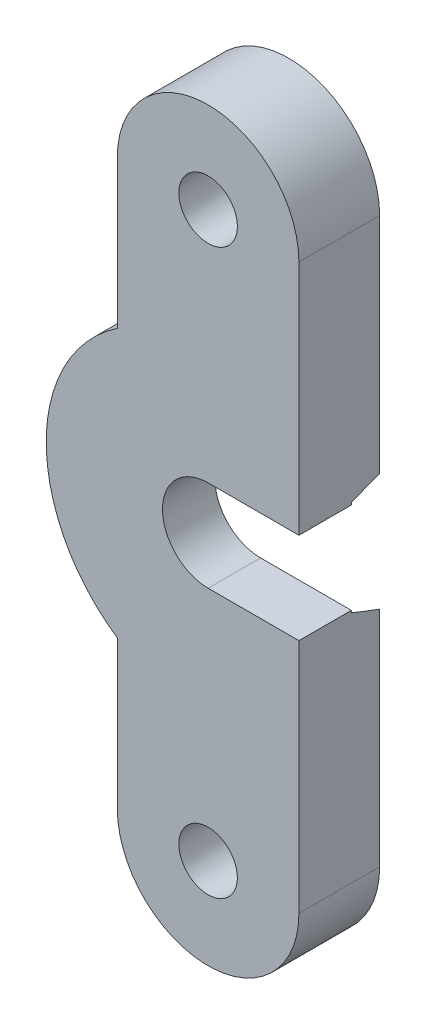
ISO-10303-21;
HEADER;
FILE_DESCRIPTION(('STEP AP214'),'2;1');
FILE_NAME('part.step','',(''),(''),'','','');
FILE_SCHEMA(('AUTOMOTIVE_DESIGN { 1 0 10303 214 1 1 1 1 }'));
ENDSEC;
DATA;
#1=APPLICATION_CONTEXT('core data for automotive mechanical design processes');
#2=APPLICATION_PROTOCOL_DEFINITION('international standard','automotive_design',2000,#1);
#3=PRODUCT_CONTEXT('',#1,'mechanical');
#4=PRODUCT('Part','Part','',(#3));
#5=PRODUCT_RELATED_PRODUCT_CATEGORY('part','',(#4));
#6=PRODUCT_DEFINITION_FORMATION('','',#4);
#7=PRODUCT_DEFINITION_CONTEXT('part definition',#1,'design');
#8=PRODUCT_DEFINITION('design','',#6,#7);
#9=PRODUCT_DEFINITION_SHAPE('','',#8);
#10=(LENGTH_UNIT() NAMED_UNIT(*) SI_UNIT(.MILLI.,.METRE.));
#11=(NAMED_UNIT(*) PLANE_ANGLE_UNIT() SI_UNIT($,.RADIAN.));
#12=(NAMED_UNIT(*) SI_UNIT($,.STERADIAN.) SOLID_ANGLE_UNIT());
#13=UNCERTAINTY_MEASURE_WITH_UNIT(LENGTH_MEASURE(1.E-05),#10,'distance_accuracy_value','');
#14=(GEOMETRIC_REPRESENTATION_CONTEXT(3) GLOBAL_UNCERTAINTY_ASSIGNED_CONTEXT((#13)) GLOBAL_UNIT_ASSIGNED_CONTEXT((#10,
#11,#12)) REPRESENTATION_CONTEXT('',''));
#15=CARTESIAN_POINT('',(0.,0.,0.));
#16=DIRECTION('',(0.,0.,1.));
#17=DIRECTION('',(1.,0.,0.));
#18=AXIS2_PLACEMENT_3D('',#15,#16,#17);
#19=CARTESIAN_POINT('',(-10.,-13.975,4.));
#20=DIRECTION('',(-1.,0.,0.));
#21=DIRECTION('',(0.,0.,1.));
#22=AXIS2_PLACEMENT_3D('',#19,#20,#21);
#23=PLANE('',#22);
#24=DIRECTION('',(0.,1.,0.));
#25=VECTOR('',#24,1.);
#26=CARTESIAN_POINT('',(-10.,-13.975,4.));
#27=LINE('',#26,#25);
#28=CARTESIAN_POINT('',(-10.,2.25018441137233,4.));
#29=VERTEX_POINT('',#28);
#30=CARTESIAN_POINT('',(-10.,13.975,4.));
#31=VERTEX_POINT('',#30);
#32=EDGE_CURVE('E205',#29,#31,#27,.T.);
#33=ORIENTED_EDGE('',*,*,#32,.F.);
#34=DIRECTION('',(0.,0.,1.));
#35=VECTOR('',#34,1.);
#36=CARTESIAN_POINT('',(-10.,2.25018441137233,-1.5));
#37=LINE('',#36,#35);
#38=CARTESIAN_POINT('',(-10.,2.25018441137233,1.4));
#39=VERTEX_POINT('',#38);
#40=EDGE_CURVE('E178',#39,#29,#37,.T.);
#41=ORIENTED_EDGE('',*,*,#40,.F.);
#42=DIRECTION('',(0.,-1.,0.));
#43=VECTOR('',#42,1.);
#44=CARTESIAN_POINT('',(-10.,-13.975,1.4));
#45=LINE('',#44,#43);
#46=CARTESIAN_POINT('',(-10.,2.35583257117824,1.4));
#47=VERTEX_POINT('',#46);
#48=EDGE_CURVE('E257',#47,#39,#45,.T.);
#49=ORIENTED_EDGE('',*,*,#48,.F.);
#50=CARTESIAN_POINT('',(-10.,-4.86011172363576,-6.48222947777975));
#51=CARTESIAN_POINT('',(-10.,-4.78518718513624,-6.19970294254902));
#52=CARTESIAN_POINT('',(-10.,-4.70953002842699,-5.9173688926268));
#53=CARTESIAN_POINT('',(-10.,-4.55648693391502,-5.353160515552));
#54=CARTESIAN_POINT('',(-10.,-4.47910094193901,-5.07128620310316));
#55=CARTESIAN_POINT('',(-10.,-4.32216785813695,-4.50746665757349));
#56=CARTESIAN_POINT('',(-10.,-4.24261636304211,-4.22552264782127));
#57=CARTESIAN_POINT('',(-10.,-4.08117119027822,-3.66230898862089));
#58=CARTESIAN_POINT('',(-10.,-3.99927754292749,-3.38103933049453));
#59=CARTESIAN_POINT('',(-10.,-3.82669467502482,-2.79903743715569));
#60=CARTESIAN_POINT('',(-10.,-3.73579738507152,-2.49836672361003));
#61=CARTESIAN_POINT('',(-10.,-3.5500924962325,-1.8982364366959));
#62=CARTESIAN_POINT('',(-10.,-3.45528495365332,-1.59877684595574));
#63=CARTESIAN_POINT('',(-10.,-3.26092528506811,-1.00191157690178));
#64=CARTESIAN_POINT('',(-10.,-3.16138082130491,-0.704503416603884));
#65=CARTESIAN_POINT('',(-10.,-2.95600571902228,-0.111886360884772));
#66=CARTESIAN_POINT('',(-10.,-2.85017564684641,0.183322729986914));
#67=CARTESIAN_POINT('',(-10.,-2.6319041584841,0.765838638631946));
#68=CARTESIAN_POINT('',(-10.,-2.51959899263945,1.05319576611338));
#69=CARTESIAN_POINT('',(-10.,-2.34233249615433,1.48112418980678));
#70=CARTESIAN_POINT('',(-10.,-2.28167114324397,1.62347490978647));
#71=CARTESIAN_POINT('',(-10.,-2.15680054303618,1.90659225357381));
#72=CARTESIAN_POINT('',(-10.,-2.09259190120757,2.04735914281075));
#73=CARTESIAN_POINT('',(-10.,-1.96096638841754,2.32423247625025));
#74=CARTESIAN_POINT('',(-10.,-1.89363009954214,2.46037703197234));
#75=CARTESIAN_POINT('',(-10.,-1.75351760473859,2.72983111910825));
#76=CARTESIAN_POINT('',(-10.,-1.68074268774304,2.86314131269468));
#77=CARTESIAN_POINT('',(-10.,-1.52834112250306,3.12498787730904));
#78=CARTESIAN_POINT('',(-10.,-1.44874771288667,3.25354347222883));
#79=CARTESIAN_POINT('',(-10.,-1.27983558657873,3.50403504832162));
#80=CARTESIAN_POINT('',(-10.,-1.19053394715101,3.62598210548131));
#81=CARTESIAN_POINT('',(-10.,-1.05923796179273,3.7841359996158));
#82=CARTESIAN_POINT('',(-10.,-1.02338509381444,3.82543470536974));
#83=CARTESIAN_POINT('',(-10.,-0.949478491917564,3.90606845734192));
#84=CARTESIAN_POINT('',(-10.,-0.911423644418572,3.94540249092188));
#85=CARTESIAN_POINT('',(-10.,-0.832937413363835,4.02137559277754));
#86=CARTESIAN_POINT('',(-10.,-0.792514406507967,4.0580232368875));
#87=CARTESIAN_POINT('',(-10.,-0.708854877121857,4.12792229599418));
#88=CARTESIAN_POINT('',(-10.,-0.665620498654955,4.16117625055419));
#89=CARTESIAN_POINT('',(-10.,-0.571004992286137,4.22664665303896));
#90=CARTESIAN_POINT('',(-10.,-0.519252439483169,4.25833721219567));
#91=CARTESIAN_POINT('',(-10.,-0.411697774082403,4.31404268513156));
#92=CARTESIAN_POINT('',(-10.,-0.355898744022683,4.33806336786477));
#93=CARTESIAN_POINT('',(-10.,-0.249557947612501,4.37304639941907));
#94=CARTESIAN_POINT('',(-10.,-0.199494013701518,4.38543256336258));
#95=CARTESIAN_POINT('',(-10.,-0.0980112248152556,4.401510926128));
#96=CARTESIAN_POINT('',(-10.,-0.0465942884791989,4.40521482908229));
#97=CARTESIAN_POINT('',(-10.,0.0561380818903218,4.40348383773648));
#98=CARTESIAN_POINT('',(-10.,0.107453341124756,4.39803884659745));
#99=CARTESIAN_POINT('',(-10.,0.208470415470152,4.37866851539885));
#100=CARTESIAN_POINT('',(-10.,0.258169958466828,4.36473173465282));
#101=CARTESIAN_POINT('',(-10.,0.373719526133597,4.32301820304059));
#102=CARTESIAN_POINT('',(-10.,0.43837241614385,4.29197214581806));
#103=CARTESIAN_POINT('',(-10.,0.562086460321429,4.2203036520996));
#104=CARTESIAN_POINT('',(-10.,0.621133888313043,4.17965851718177));
#105=CARTESIAN_POINT('',(-10.,0.731271318534876,4.09406620943648));
#106=CARTESIAN_POINT('',(-10.,0.782611059668518,4.04943367445645));
#107=CARTESIAN_POINT('',(-10.,0.881374062173893,3.9559892177687));
#108=CARTESIAN_POINT('',(-10.,0.928793339502609,3.90717314479839));
#109=CARTESIAN_POINT('',(-10.,1.02045204590971,3.80638748319774));
#110=CARTESIAN_POINT('',(-10.,1.06468088108099,3.7544083580207));
#111=CARTESIAN_POINT('',(-10.,1.15030927755816,3.64823134037082));
#112=CARTESIAN_POINT('',(-10.,1.19171022960356,3.5940345598092));
#113=CARTESIAN_POINT('',(-10.,1.30760992576609,3.43543038380133));
#114=CARTESIAN_POINT('',(-10.,1.37913375000838,3.32885317124975));
#115=CARTESIAN_POINT('',(-10.,1.51603922343236,3.11179642326028));
#116=CARTESIAN_POINT('',(-10.,1.581416488148,3.00131417842887));
#117=CARTESIAN_POINT('',(-10.,1.70753159962115,2.77743357604012));
#118=CARTESIAN_POINT('',(-10.,1.76825912518094,2.66402943760772));
#119=CARTESIAN_POINT('',(-10.,1.88590772751434,2.43525571634378));
#120=CARTESIAN_POINT('',(-10.,1.94282817446706,2.31988581224918));
#121=CARTESIAN_POINT('',(-10.,2.10989911129234,1.96966827954571));
#122=CARTESIAN_POINT('',(-10.,2.21534402331926,1.73257932443242));
#123=CARTESIAN_POINT('',(-10.,2.41739497180174,1.25513134521259));
#124=CARTESIAN_POINT('',(-10.,2.51401337910908,1.01477745757509));
#125=CARTESIAN_POINT('',(-10.,2.72418830669264,0.471166399164185));
#126=CARTESIAN_POINT('',(-10.,2.83593677304769,0.167212704637276));
#127=CARTESIAN_POINT('',(-10.,3.05216337802057,-0.443282095321528));
#128=CARTESIAN_POINT('',(-10.,3.15664066641763,-0.749823498651549));
#129=CARTESIAN_POINT('',(-10.,3.36014722101228,-1.36507454633774));
#130=CARTESIAN_POINT('',(-10.,3.45917039762246,-1.6737861970327));
#131=CARTESIAN_POINT('',(-10.,3.65283412493359,-2.29258201259514));
#132=CARTESIAN_POINT('',(-10.,3.74747458977605,-2.60266620422079));
#133=CARTESIAN_POINT('',(-10.,3.92890911576825,-3.20950077194064));
#134=CARTESIAN_POINT('',(-10.,4.01586355891195,-3.50620333307373));
#135=CARTESIAN_POINT('',(-10.,4.18709192697875,-4.10038526391645));
#136=CARTESIAN_POINT('',(-10.,4.27136580378277,-4.39786464746729));
#137=CARTESIAN_POINT('',(-10.,4.4374885712839,-4.99286617016361));
#138=CARTESIAN_POINT('',(-10.,4.51934191614788,-5.29038706826824));
#139=CARTESIAN_POINT('',(-10.,4.68110531444357,-5.88594397271175));
#140=CARTESIAN_POINT('',(-10.,4.76101544729948,-6.18397995746258));
#141=CARTESIAN_POINT('',(-10.,4.84011172363604,-6.48222947777923));
#142=B_SPLINE_CURVE_WITH_KNOTS('',3,(#50,#51,#52,#53,#54,#55,#56,#57,#58,#59,#60,#61,#62,#63,
#64,#65,#66,#67,#68,#69,#70,#71,#72,#73,#74,#75,#76,#77,#78,#79,#80,#81,#82,#83,#84,#85,#86,#87,
#88,#89,#90,#91,#92,#93,#94,#95,#96,#97,#98,#99,#100,#101,#102,#103,#104,#105,#106,#107,#108,
#109,#110,#111,#112,#113,#114,#115,#116,#117,#118,#119,#120,#121,#122,#123,#124,#125,#126,#127,
#128,#129,#130,#131,#132,#133,#134,#135,#136,#137,#138,#139,#140,#141),.UNSPECIFIED.,.F.,.F.,(4,
2,2,2,2,2,2,2,2,2,2,2,2,2,2,2,2,2,2,2,2,2,2,2,2,2,2,2,2,2,2,2,2,2,2,2,2,2,2,2,2,2,2,2,2,4),(0.,
0.876879220836205,1.75378595744643,2.63263316453783,3.51146900041312,4.45377780010958,
5.39607303555693,6.33689268837361,7.27762770002801,8.20299438853204,8.66716899835432,
9.13126462387282,9.58683654110926,10.0423008299895,10.4956590402018,10.9482322939344,
11.1122415980218,11.2763345820244,11.4398785882992,11.6032992999514,11.784879179384,
11.9663221586804,12.120376552953,12.2742231542845,12.4282396542757,12.5824641154554,
12.7964005236903,13.0108479724893,13.2146263469333,13.4186093222698,13.6232411080103,
13.8277715212266,14.2124946160236,14.5974900919234,14.9833167693428,15.369207118602,
16.1473525265043,16.924390027437,17.895784251356,18.8672918704817,19.8398630734865,
20.8124533213636,21.73998443822,22.6675321958868,23.5932509104111,24.5189317245582),.UNSPECIFIED.);
#143=CARTESIAN_POINT('',(-10.,2.89486973206636,0.));
#144=VERTEX_POINT('',#143);
#145=EDGE_CURVE('E260',#47,#144,#142,.T.);
#146=ORIENTED_EDGE('',*,*,#145,.T.);
#147=DIRECTION('',(0.,1.,0.));
#148=VECTOR('',#147,1.);
#149=CARTESIAN_POINT('',(-10.,-13.975,0.));
#150=LINE('',#149,#148);
#151=CARTESIAN_POINT('',(-10.,13.975,0.));
#152=VERTEX_POINT('',#151);
#153=EDGE_CURVE('E223',#144,#152,#150,.T.);
#154=ORIENTED_EDGE('',*,*,#153,.T.);
#155=DIRECTION('',(0.,0.,-1.));
#156=VECTOR('',#155,1.);
#157=CARTESIAN_POINT('',(-10.,13.975,4.));
#158=LINE('',#157,#156);
#159=EDGE_CURVE('E248',#31,#152,#158,.T.);
#160=ORIENTED_EDGE('',*,*,#159,.F.);
#161=EDGE_LOOP('',(#33,#41,#49,#146,#154,#160));
#162=FACE_BOUND('',#161,.T.);
#163=ADVANCED_FACE('F39',(#162),#23,.F.);
#164=CARTESIAN_POINT('',(-14.5,-13.975,4.));
#165=DIRECTION('',(0.,0.,1.));
#166=DIRECTION('',(1.,0.,0.));
#167=AXIS2_PLACEMENT_3D('',#164,#165,#166);
#168=PLANE('',#167);
#169=DIRECTION('',(-1.,0.,0.));
#170=VECTOR('',#169,1.);
#171=CARTESIAN_POINT('',(-14.5000000000003,2.25018441137233,4.));
#172=LINE('',#171,#170);
#173=CARTESIAN_POINT('',(-14.5000000000003,2.25018441137233,4.));
#174=VERTEX_POINT('',#173);
#175=EDGE_CURVE('E152',#29,#174,#172,.T.);
#176=ORIENTED_EDGE('',*,*,#175,.F.);
#177=ORIENTED_EDGE('',*,*,#32,.T.);
#178=CARTESIAN_POINT('',(-14.5,13.975,4.));
#179=DIRECTION('',(0.,0.,1.));
#180=DIRECTION('',(1.,0.,0.));
#181=AXIS2_PLACEMENT_3D('',#178,#179,#180);
#182=CIRCLE('',#181,4.5);
#183=CARTESIAN_POINT('',(-19.,13.975,4.));
#184=VERTEX_POINT('',#183);
#185=EDGE_CURVE('E209',#31,#184,#182,.T.);
#186=ORIENTED_EDGE('',*,*,#185,.T.);
#187=DIRECTION('',(0.,-1.,0.));
#188=VECTOR('',#187,1.);
#189=CARTESIAN_POINT('',(-19.,6.6319612567797,4.));
#190=LINE('',#189,#188);
#191=CARTESIAN_POINT('',(-19.,6.6319612567797,4.));
#192=VERTEX_POINT('',#191);
#193=EDGE_CURVE('E212',#184,#192,#190,.T.);
#194=ORIENTED_EDGE('',*,*,#193,.T.);
#195=CARTESIAN_POINT('',(-14.5000000000003,-0.010000000000117,4.));
#196=DIRECTION('',(0.,0.,1.));
#197=DIRECTION('',(1.,0.,0.));
#198=AXIS2_PLACEMENT_3D('',#195,#196,#197);
#199=CIRCLE('',#198,8.02282053498401);
#200=CARTESIAN_POINT('',(-19.,-6.65196125677994,4.));
#201=VERTEX_POINT('',#200);
#202=EDGE_CURVE('E215',#192,#201,#199,.T.);
#203=ORIENTED_EDGE('',*,*,#202,.T.);
#204=DIRECTION('',(0.,-1.,0.));
#205=VECTOR('',#204,1.);
#206=CARTESIAN_POINT('',(-19.,-13.975,4.));
#207=LINE('',#206,#205);
#208=CARTESIAN_POINT('',(-19.,-13.975,4.));
#209=VERTEX_POINT('',#208);
#210=EDGE_CURVE('E217',#201,#209,#207,.T.);
#211=ORIENTED_EDGE('',*,*,#210,.T.);
#212=CARTESIAN_POINT('',(-14.5,-13.975,4.));
#213=DIRECTION('',(0.,0.,1.));
#214=DIRECTION('',(1.,0.,0.));
#215=AXIS2_PLACEMENT_3D('',#212,#213,#214);
#216=CIRCLE('',#215,4.5);
#217=CARTESIAN_POINT('',(-10.,-13.975,4.));
#218=VERTEX_POINT('',#217);
#219=EDGE_CURVE('E202',#209,#218,#216,.T.);
#220=ORIENTED_EDGE('',*,*,#219,.T.);
#221=CARTESIAN_POINT('',(-10.,-2.27018441137256,4.));
#222=VERTEX_POINT('',#221);
#223=EDGE_CURVE('E168',#218,#222,#27,.T.);
#224=ORIENTED_EDGE('',*,*,#223,.T.);
#225=DIRECTION('',(1.,0.,0.));
#226=VECTOR('',#225,1.);
#227=CARTESIAN_POINT('',(-14.5000000000003,-2.27018441137256,4.));
#228=LINE('',#227,#226);
#229=CARTESIAN_POINT('',(-14.5000000000003,-2.27018441137256,4.));
#230=VERTEX_POINT('',#229);
#231=EDGE_CURVE('E147',#230,#222,#228,.T.);
#232=ORIENTED_EDGE('',*,*,#231,.F.);
#233=CARTESIAN_POINT('',(-14.5000000000003,-0.010000000000117,4.));
#234=DIRECTION('',(0.,0.,1.));
#235=DIRECTION('',(1.,0.,0.));
#236=AXIS2_PLACEMENT_3D('',#233,#234,#235);
#237=CIRCLE('',#236,2.26018441137245);
#238=EDGE_CURVE('E155',#174,#230,#237,.T.);
#239=ORIENTED_EDGE('',*,*,#238,.F.);
#240=EDGE_LOOP('',(#176,#177,#186,#194,#203,#211,#220,#224,#232,#239));
#241=FACE_BOUND('',#240,.T.);
#242=CARTESIAN_POINT('',(-14.5,-13.975,4.));
#243=DIRECTION('',(0.,0.,1.));
#244=DIRECTION('',(1.,0.,0.));
#245=AXIS2_PLACEMENT_3D('',#242,#243,#244);
#246=CIRCLE('',#245,1.45);
#247=CARTESIAN_POINT('',(-13.05,-13.975,4.));
#248=VERTEX_POINT('',#247);
#249=EDGE_CURVE('E195',#248,#248,#246,.T.);
#250=ORIENTED_EDGE('',*,*,#249,.F.);
#251=EDGE_LOOP('',(#250));
#252=FACE_BOUND('',#251,.T.);
#253=CARTESIAN_POINT('',(-14.5,13.975,4.));
#254=DIRECTION('',(0.,0.,1.));
#255=DIRECTION('',(1.,0.,0.));
#256=AXIS2_PLACEMENT_3D('',#253,#254,#255);
#257=CIRCLE('',#256,1.45);
#258=CARTESIAN_POINT('',(-13.05,13.975,4.));
#259=VERTEX_POINT('',#258);
#260=EDGE_CURVE('E187',#259,#259,#257,.T.);
#261=ORIENTED_EDGE('',*,*,#260,.F.);
#262=EDGE_LOOP('',(#261));
#263=FACE_BOUND('',#262,.T.);
#264=ADVANCED_FACE('F165',(#241,#252,#263),#168,.T.);
#265=CARTESIAN_POINT('',(-14.5,-13.975,0.));
#266=DIRECTION('',(0.,0.,1.));
#267=DIRECTION('',(1.,0.,0.));
#268=AXIS2_PLACEMENT_3D('',#265,#266,#267);
#269=PLANE('',#268);
#270=CARTESIAN_POINT('',(-14.5,-13.975,0.));
#271=DIRECTION('',(0.,0.,1.));
#272=DIRECTION('',(1.,0.,0.));
#273=AXIS2_PLACEMENT_3D('',#270,#271,#272);
#274=CIRCLE('',#273,1.45);
#275=CARTESIAN_POINT('',(-13.05,-13.975,0.));
#276=VERTEX_POINT('',#275);
#277=EDGE_CURVE('E191',#276,#276,#274,.T.);
#278=ORIENTED_EDGE('',*,*,#277,.T.);
#279=EDGE_LOOP('',(#278));
#280=FACE_BOUND('',#279,.T.);
#281=ORIENTED_EDGE('',*,*,#153,.F.);
#282=CARTESIAN_POINT('',(-14.5000000000003,-0.010000000000117,0.));
#283=DIRECTION('',(0.,0.,-1.));
#284=DIRECTION('',(-1.,0.,0.));
#285=AXIS2_PLACEMENT_3D('',#282,#283,#284);
#286=CIRCLE('',#285,5.35614303022979);
#287=CARTESIAN_POINT('',(-10.,-2.9148697320666,0.));
#288=VERTEX_POINT('',#287);
#289=EDGE_CURVE('E177',#288,#144,#286,.T.);
#290=ORIENTED_EDGE('',*,*,#289,.F.);
#291=CARTESIAN_POINT('',(-10.,-13.975,0.));
#292=VERTEX_POINT('',#291);
#293=EDGE_CURVE('E224',#292,#288,#150,.T.);
#294=ORIENTED_EDGE('',*,*,#293,.F.);
#295=CARTESIAN_POINT('',(-14.5,-13.975,0.));
#296=DIRECTION('',(0.,0.,1.));
#297=DIRECTION('',(1.,0.,0.));
#298=AXIS2_PLACEMENT_3D('',#295,#296,#297);
#299=CIRCLE('',#298,4.5);
#300=CARTESIAN_POINT('',(-19.,-13.975,0.));
#301=VERTEX_POINT('',#300);
#302=EDGE_CURVE('E198',#301,#292,#299,.T.);
#303=ORIENTED_EDGE('',*,*,#302,.F.);
#304=DIRECTION('',(0.,-1.,0.));
#305=VECTOR('',#304,1.);
#306=CARTESIAN_POINT('',(-19.,-13.975,0.));
#307=LINE('',#306,#305);
#308=CARTESIAN_POINT('',(-19.,-6.65196125677994,0.));
#309=VERTEX_POINT('',#308);
#310=EDGE_CURVE('E206',#309,#301,#307,.T.);
#311=ORIENTED_EDGE('',*,*,#310,.F.);
#312=CARTESIAN_POINT('',(-14.5000000000003,-0.010000000000117,0.));
#313=DIRECTION('',(0.,0.,1.));
#314=DIRECTION('',(1.,0.,0.));
#315=AXIS2_PLACEMENT_3D('',#312,#313,#314);
#316=CIRCLE('',#315,8.02282053498401);
#317=CARTESIAN_POINT('',(-19.,6.6319612567797,0.));
#318=VERTEX_POINT('',#317);
#319=EDGE_CURVE('E233',#318,#309,#316,.T.);
#320=ORIENTED_EDGE('',*,*,#319,.F.);
#321=DIRECTION('',(0.,-1.,0.));
#322=VECTOR('',#321,1.);
#323=CARTESIAN_POINT('',(-19.,6.6319612567797,0.));
#324=LINE('',#323,#322);
#325=CARTESIAN_POINT('',(-19.,13.975,0.));
#326=VERTEX_POINT('',#325);
#327=EDGE_CURVE('E231',#326,#318,#324,.T.);
#328=ORIENTED_EDGE('',*,*,#327,.F.);
#329=CARTESIAN_POINT('',(-14.5,13.975,0.));
#330=DIRECTION('',(0.,0.,1.));
#331=DIRECTION('',(1.,0.,0.));
#332=AXIS2_PLACEMENT_3D('',#329,#330,#331);
#333=CIRCLE('',#332,4.5);
#334=EDGE_CURVE('E228',#152,#326,#333,.T.);
#335=ORIENTED_EDGE('',*,*,#334,.F.);
#336=EDGE_LOOP('',(#281,#290,#294,#303,#311,#320,#328,#335));
#337=FACE_BOUND('',#336,.T.);
#338=CARTESIAN_POINT('',(-14.5,13.975,0.));
#339=DIRECTION('',(0.,0.,1.));
#340=DIRECTION('',(1.,0.,0.));
#341=AXIS2_PLACEMENT_3D('',#338,#339,#340);
#342=CIRCLE('',#341,1.45);
#343=CARTESIAN_POINT('',(-13.05,13.975,0.));
#344=VERTEX_POINT('',#343);
#345=EDGE_CURVE('E186',#344,#344,#342,.T.);
#346=ORIENTED_EDGE('',*,*,#345,.T.);
#347=EDGE_LOOP('',(#346));
#348=FACE_BOUND('',#347,.T.);
#349=ADVANCED_FACE('F291',(#280,#337,#348),#269,.F.);
#350=CARTESIAN_POINT('',(-14.5,-13.975,4.));
#351=DIRECTION('',(0.,0.,-1.));
#352=DIRECTION('',(-1.,0.,0.));
#353=AXIS2_PLACEMENT_3D('',#350,#351,#352);
#354=CYLINDRICAL_SURFACE('',#353,4.5);
#355=ORIENTED_EDGE('',*,*,#302,.T.);
#356=DIRECTION('',(0.,0.,-1.));
#357=VECTOR('',#356,1.);
#358=CARTESIAN_POINT('',(-10.,-13.975,4.));
#359=LINE('',#358,#357);
#360=EDGE_CURVE('E252',#218,#292,#359,.T.);
#361=ORIENTED_EDGE('',*,*,#360,.F.);
#362=ORIENTED_EDGE('',*,*,#219,.F.);
#363=DIRECTION('',(0.,0.,-1.));
#364=VECTOR('',#363,1.);
#365=CARTESIAN_POINT('',(-19.,-13.975,4.));
#366=LINE('',#365,#364);
#367=EDGE_CURVE('E219',#209,#301,#366,.T.);
#368=ORIENTED_EDGE('',*,*,#367,.T.);
#369=EDGE_LOOP('',(#355,#361,#362,#368));
#370=FACE_BOUND('',#369,.T.);
#371=ADVANCED_FACE('F41',(#370),#354,.T.);
#372=CARTESIAN_POINT('',(-10.,-2.27018441137256,1.4));
#373=VERTEX_POINT('',#372);
#374=CARTESIAN_POINT('',(-10.,-2.37583257117847,1.4));
#375=VERTEX_POINT('',#374);
#376=EDGE_CURVE('E256',#373,#375,#45,.T.);
#377=ORIENTED_EDGE('',*,*,#376,.F.);
#378=DIRECTION('',(0.,0.,1.));
#379=VECTOR('',#378,1.);
#380=CARTESIAN_POINT('',(-10.,-2.27018441137256,-1.5));
#381=LINE('',#380,#379);
#382=EDGE_CURVE('E58',#373,#222,#381,.T.);
#383=ORIENTED_EDGE('',*,*,#382,.T.);
#384=ORIENTED_EDGE('',*,*,#223,.F.);
#385=ORIENTED_EDGE('',*,*,#360,.T.);
#386=ORIENTED_EDGE('',*,*,#293,.T.);
#387=EDGE_CURVE('E268',#288,#375,#142,.T.);
#388=ORIENTED_EDGE('',*,*,#387,.T.);
#389=EDGE_LOOP('',(#377,#383,#384,#385,#386,#388));
#390=FACE_BOUND('',#389,.T.);
#391=ADVANCED_FACE('F269',(#390),#23,.F.);
#392=CARTESIAN_POINT('',(-14.5,13.975,4.));
#393=DIRECTION('',(0.,0.,-1.));
#394=DIRECTION('',(-1.,0.,0.));
#395=AXIS2_PLACEMENT_3D('',#392,#393,#394);
#396=CYLINDRICAL_SURFACE('',#395,4.5);
#397=ORIENTED_EDGE('',*,*,#334,.T.);
#398=DIRECTION('',(0.,0.,-1.));
#399=VECTOR('',#398,1.);
#400=CARTESIAN_POINT('',(-19.,13.975,4.));
#401=LINE('',#400,#399);
#402=EDGE_CURVE('E244',#184,#326,#401,.T.);
#403=ORIENTED_EDGE('',*,*,#402,.F.);
#404=ORIENTED_EDGE('',*,*,#185,.F.);
#405=ORIENTED_EDGE('',*,*,#159,.T.);
#406=EDGE_LOOP('',(#397,#403,#404,#405));
#407=FACE_BOUND('',#406,.T.);
#408=ADVANCED_FACE('F304',(#407),#396,.T.);
#409=CARTESIAN_POINT('',(-19.,6.6319612567797,4.));
#410=DIRECTION('',(1.,0.,0.));
#411=DIRECTION('',(0.,1.,0.));
#412=AXIS2_PLACEMENT_3D('',#409,#410,#411);
#413=PLANE('',#412);
#414=ORIENTED_EDGE('',*,*,#327,.T.);
#415=DIRECTION('',(0.,0.,-1.));
#416=VECTOR('',#415,1.);
#417=CARTESIAN_POINT('',(-19.,6.6319612567797,4.));
#418=LINE('',#417,#416);
#419=EDGE_CURVE('E241',#192,#318,#418,.T.);
#420=ORIENTED_EDGE('',*,*,#419,.F.);
#421=ORIENTED_EDGE('',*,*,#193,.F.);
#422=ORIENTED_EDGE('',*,*,#402,.T.);
#423=EDGE_LOOP('',(#414,#420,#421,#422));
#424=FACE_BOUND('',#423,.T.);
#425=ADVANCED_FACE('F301',(#424),#413,.F.);
#426=CARTESIAN_POINT('',(-14.5000000000003,-0.010000000000117,4.));
#427=DIRECTION('',(0.,0.,-1.));
#428=DIRECTION('',(-1.,0.,0.));
#429=AXIS2_PLACEMENT_3D('',#426,#427,#428);
#430=CYLINDRICAL_SURFACE('',#429,8.02282053498401);
#431=ORIENTED_EDGE('',*,*,#319,.T.);
#432=DIRECTION('',(0.,0.,-1.));
#433=VECTOR('',#432,1.);
#434=CARTESIAN_POINT('',(-19.,-6.65196125677994,4.));
#435=LINE('',#434,#433);
#436=EDGE_CURVE('E238',#201,#309,#435,.T.);
#437=ORIENTED_EDGE('',*,*,#436,.F.);
#438=ORIENTED_EDGE('',*,*,#202,.F.);
#439=ORIENTED_EDGE('',*,*,#419,.T.);
#440=EDGE_LOOP('',(#431,#437,#438,#439));
#441=FACE_BOUND('',#440,.T.);
#442=ADVANCED_FACE('F297',(#441),#430,.T.);
#443=CARTESIAN_POINT('',(-19.,-13.975,4.));
#444=DIRECTION('',(1.,0.,0.));
#445=DIRECTION('',(0.,1.,0.));
#446=AXIS2_PLACEMENT_3D('',#443,#444,#445);
#447=PLANE('',#446);
#448=ORIENTED_EDGE('',*,*,#310,.T.);
#449=ORIENTED_EDGE('',*,*,#367,.F.);
#450=ORIENTED_EDGE('',*,*,#210,.F.);
#451=ORIENTED_EDGE('',*,*,#436,.T.);
#452=EDGE_LOOP('',(#448,#449,#450,#451));
#453=FACE_BOUND('',#452,.T.);
#454=ADVANCED_FACE('F287',(#453),#447,.F.);
#455=CARTESIAN_POINT('',(-14.5,-13.975,4.));
#456=DIRECTION('',(0.,0.,-1.));
#457=DIRECTION('',(-1.,0.,0.));
#458=AXIS2_PLACEMENT_3D('',#455,#456,#457);
#459=CYLINDRICAL_SURFACE('',#458,1.45);
#460=ORIENTED_EDGE('',*,*,#249,.T.);
#461=EDGE_LOOP('',(#460));
#462=FACE_BOUND('',#461,.T.);
#463=ORIENTED_EDGE('',*,*,#277,.F.);
#464=EDGE_LOOP('',(#463));
#465=FACE_BOUND('',#464,.T.);
#466=ADVANCED_FACE('F283',(#462,#465),#459,.F.);
#467=CARTESIAN_POINT('',(-14.5,13.975,4.));
#468=DIRECTION('',(0.,0.,-1.));
#469=DIRECTION('',(-1.,0.,0.));
#470=AXIS2_PLACEMENT_3D('',#467,#468,#469);
#471=CYLINDRICAL_SURFACE('',#470,1.45);
#472=ORIENTED_EDGE('',*,*,#260,.T.);
#473=EDGE_LOOP('',(#472));
#474=FACE_BOUND('',#473,.T.);
#475=ORIENTED_EDGE('',*,*,#345,.F.);
#476=EDGE_LOOP('',(#475));
#477=FACE_BOUND('',#476,.T.);
#478=ADVANCED_FACE('F278',(#474,#477),#471,.F.);
#479=CARTESIAN_POINT('',(-14.5000000000003,-0.010000000000117,0.));
#480=DIRECTION('',(0.,0.,-1.));
#481=DIRECTION('',(-1.,0.,0.));
#482=AXIS2_PLACEMENT_3D('',#479,#480,#481);
#483=CONICAL_SURFACE('',#482,5.35614303022979,0.191986217719377);
#484=ORIENTED_EDGE('',*,*,#289,.T.);
#485=ORIENTED_EDGE('',*,*,#145,.F.);
#486=CARTESIAN_POINT('',(-14.5000000000003,-0.010000000000117,1.4));
#487=DIRECTION('',(0.,0.,-1.));
#488=DIRECTION('',(-1.,0.,0.));
#489=AXIS2_PLACEMENT_3D('',#486,#487,#488);
#490=CIRCLE('',#489,5.08401059743698);
#491=EDGE_CURVE('E69',#375,#47,#490,.T.);
#492=ORIENTED_EDGE('',*,*,#491,.F.);
#493=ORIENTED_EDGE('',*,*,#387,.F.);
#494=EDGE_LOOP('',(#484,#485,#492,#493));
#495=FACE_BOUND('',#494,.T.);
#496=ADVANCED_FACE('F272',(#495),#483,.F.);
#497=CARTESIAN_POINT('',(-14.5000000000003,-0.010000000000117,1.4));
#498=DIRECTION('',(0.,0.,-1.));
#499=DIRECTION('',(-1.,0.,0.));
#500=AXIS2_PLACEMENT_3D('',#497,#498,#499);
#501=PLANE('',#500);
#502=DIRECTION('',(1.,0.,0.));
#503=VECTOR('',#502,1.);
#504=CARTESIAN_POINT('',(-14.5000000000003,2.25018441137233,1.4));
#505=LINE('',#504,#503);
#506=CARTESIAN_POINT('',(-14.5000000000003,2.25018441137233,1.4));
#507=VERTEX_POINT('',#506);
#508=EDGE_CURVE('E11',#507,#39,#505,.T.);
#509=ORIENTED_EDGE('',*,*,#508,.F.);
#510=CARTESIAN_POINT('',(-14.5000000000003,-0.010000000000117,1.4));
#511=DIRECTION('',(0.,0.,-1.));
#512=DIRECTION('',(-1.,0.,0.));
#513=AXIS2_PLACEMENT_3D('',#510,#511,#512);
#514=CIRCLE('',#513,2.26018441137245);
#515=CARTESIAN_POINT('',(-14.5000000000003,-2.27018441137256,1.4));
#516=VERTEX_POINT('',#515);
#517=EDGE_CURVE('E48',#516,#507,#514,.T.);
#518=ORIENTED_EDGE('',*,*,#517,.F.);
#519=DIRECTION('',(-1.,0.,0.));
#520=VECTOR('',#519,1.);
#521=CARTESIAN_POINT('',(-14.5000000000003,-2.27018441137256,1.4));
#522=LINE('',#521,#520);
#523=EDGE_CURVE('E148',#373,#516,#522,.T.);
#524=ORIENTED_EDGE('',*,*,#523,.F.);
#525=ORIENTED_EDGE('',*,*,#376,.T.);
#526=ORIENTED_EDGE('',*,*,#491,.T.);
#527=ORIENTED_EDGE('',*,*,#48,.T.);
#528=EDGE_LOOP('',(#509,#518,#524,#525,#526,#527));
#529=FACE_BOUND('',#528,.T.);
#530=ADVANCED_FACE('F277',(#529),#501,.T.);
#531=CARTESIAN_POINT('',(-14.5000000000003,-0.010000000000117,-1.5));
#532=DIRECTION('',(0.,0.,1.));
#533=DIRECTION('',(1.,0.,0.));
#534=AXIS2_PLACEMENT_3D('',#531,#532,#533);
#535=CYLINDRICAL_SURFACE('',#534,2.26018441137245);
#536=ORIENTED_EDGE('',*,*,#517,.T.);
#537=DIRECTION('',(0.,0.,1.));
#538=VECTOR('',#537,1.);
#539=CARTESIAN_POINT('',(-14.5000000000003,2.25018441137233,-1.5));
#540=LINE('',#539,#538);
#541=EDGE_CURVE('E158',#507,#174,#540,.T.);
#542=ORIENTED_EDGE('',*,*,#541,.T.);
#543=ORIENTED_EDGE('',*,*,#238,.T.);
#544=DIRECTION('',(0.,0.,1.));
#545=VECTOR('',#544,1.);
#546=CARTESIAN_POINT('',(-14.5000000000003,-2.27018441137256,-1.5));
#547=LINE('',#546,#545);
#548=EDGE_CURVE('E143',#516,#230,#547,.T.);
#549=ORIENTED_EDGE('',*,*,#548,.F.);
#550=EDGE_LOOP('',(#536,#542,#543,#549));
#551=FACE_BOUND('',#550,.T.);
#552=ADVANCED_FACE('F156',(#551),#535,.F.);
#553=CARTESIAN_POINT('',(-14.5000000000003,2.25018441137233,-1.5));
#554=DIRECTION('',(0.,1.,0.));
#555=DIRECTION('',(0.,0.,1.));
#556=AXIS2_PLACEMENT_3D('',#553,#554,#555);
#557=PLANE('',#556);
#558=ORIENTED_EDGE('',*,*,#508,.T.);
#559=ORIENTED_EDGE('',*,*,#40,.T.);
#560=ORIENTED_EDGE('',*,*,#175,.T.);
#561=ORIENTED_EDGE('',*,*,#541,.F.);
#562=EDGE_LOOP('',(#558,#559,#560,#561));
#563=FACE_BOUND('',#562,.T.);
#564=ADVANCED_FACE('F324',(#563),#557,.F.);
#565=CARTESIAN_POINT('',(-14.5000000000003,-2.27018441137256,-1.5));
#566=DIRECTION('',(0.,-1.,0.));
#567=DIRECTION('',(0.,0.,-1.));
#568=AXIS2_PLACEMENT_3D('',#565,#566,#567);
#569=PLANE('',#568);
#570=ORIENTED_EDGE('',*,*,#523,.T.);
#571=ORIENTED_EDGE('',*,*,#548,.T.);
#572=ORIENTED_EDGE('',*,*,#231,.T.);
#573=ORIENTED_EDGE('',*,*,#382,.F.);
#574=EDGE_LOOP('',(#570,#571,#572,#573));
#575=FACE_BOUND('',#574,.T.);
#576=ADVANCED_FACE('F145',(#575),#569,.F.);
#577=CLOSED_SHELL('',(#163,#264,#349,#371,#391,#408,#425,#442,#454,#466,#478,#496,#530,#552,
#564,#576));
#578=MANIFOLD_SOLID_BREP('B2',#577);
#579=ADVANCED_BREP_SHAPE_REPRESENTATION('',(#18,#578),#14);
#580=SHAPE_DEFINITION_REPRESENTATION(#9,#579);
ENDSEC;
END-ISO-10303-21;
